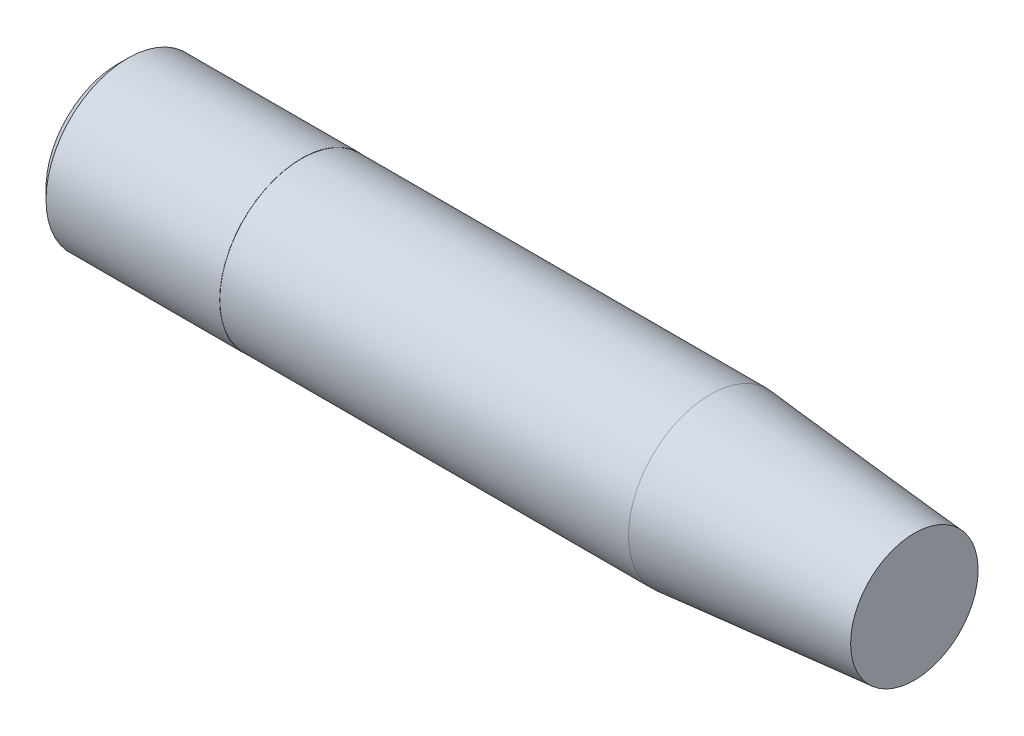
ISO-10303-21;
HEADER;
FILE_DESCRIPTION(('STEP AP214'),'2;1');
FILE_NAME('part.step','',(''),(''),'','','');
FILE_SCHEMA(('AUTOMOTIVE_DESIGN { 1 0 10303 214 1 1 1 1 }'));
ENDSEC;
DATA;
#1=APPLICATION_CONTEXT('core data for automotive mechanical design processes');
#2=APPLICATION_PROTOCOL_DEFINITION('international standard','automotive_design',2000,#1);
#3=PRODUCT_CONTEXT('',#1,'mechanical');
#4=PRODUCT('Part','Part','',(#3));
#5=PRODUCT_RELATED_PRODUCT_CATEGORY('part','',(#4));
#6=PRODUCT_DEFINITION_FORMATION('','',#4);
#7=PRODUCT_DEFINITION_CONTEXT('part definition',#1,'design');
#8=PRODUCT_DEFINITION('design','',#6,#7);
#9=PRODUCT_DEFINITION_SHAPE('','',#8);
#10=(LENGTH_UNIT() NAMED_UNIT(*) SI_UNIT(.MILLI.,.METRE.));
#11=(NAMED_UNIT(*) PLANE_ANGLE_UNIT() SI_UNIT($,.RADIAN.));
#12=(NAMED_UNIT(*) SI_UNIT($,.STERADIAN.) SOLID_ANGLE_UNIT());
#13=UNCERTAINTY_MEASURE_WITH_UNIT(LENGTH_MEASURE(1.E-05),#10,'distance_accuracy_value','');
#14=(GEOMETRIC_REPRESENTATION_CONTEXT(3) GLOBAL_UNCERTAINTY_ASSIGNED_CONTEXT((#13)) GLOBAL_UNIT_ASSIGNED_CONTEXT((#10,
#11,#12)) REPRESENTATION_CONTEXT('',''));
#15=CARTESIAN_POINT('',(0.,0.,0.));
#16=DIRECTION('',(0.,0.,1.));
#17=DIRECTION('',(1.,0.,0.));
#18=AXIS2_PLACEMENT_3D('',#15,#16,#17);
#19=CARTESIAN_POINT('',(19.5,0.,0.));
#20=DIRECTION('',(-1.,0.,0.));
#21=DIRECTION('',(0.,0.,1.));
#22=AXIS2_PLACEMENT_3D('',#19,#20,#21);
#23=PLANE('',#22);
#24=CARTESIAN_POINT('',(19.5,0.,0.));
#25=DIRECTION('',(-1.,0.,0.));
#26=DIRECTION('',(0.,0.,1.));
#27=AXIS2_PLACEMENT_3D('',#24,#25,#26);
#28=CIRCLE('',#27,1.56005668237038);
#29=CARTESIAN_POINT('',(19.5,0.,1.56005668237038));
#30=VERTEX_POINT('',#29);
#31=EDGE_CURVE('E10',#30,#30,#28,.T.);
#32=ORIENTED_EDGE('',*,*,#31,.F.);
#33=EDGE_LOOP('',(#32));
#34=FACE_BOUND('',#33,.T.);
#35=ADVANCED_FACE('F33',(#34),#23,.F.);
#36=CARTESIAN_POINT('',(19.5,0.,0.));
#37=DIRECTION('',(-1.,0.,0.));
#38=DIRECTION('',(0.,0.,1.));
#39=AXIS2_PLACEMENT_3D('',#36,#37,#38);
#40=CONICAL_SURFACE('',#39,1.56005668237038,0.0872664625997163);
#41=CARTESIAN_POINT('',(14.5,0.,0.));
#42=DIRECTION('',(-1.,0.,0.));
#43=DIRECTION('',(0.,0.,1.));
#44=AXIS2_PLACEMENT_3D('',#41,#42,#43);
#45=CIRCLE('',#44,1.9975);
#46=CARTESIAN_POINT('',(14.5,0.,1.9975));
#47=VERTEX_POINT('',#46);
#48=EDGE_CURVE('E39',#47,#47,#45,.T.);
#49=ORIENTED_EDGE('',*,*,#48,.F.);
#50=EDGE_LOOP('',(#49));
#51=FACE_BOUND('',#50,.T.);
#52=ORIENTED_EDGE('',*,*,#31,.T.);
#53=EDGE_LOOP('',(#52));
#54=FACE_BOUND('',#53,.T.);
#55=ADVANCED_FACE('F71',(#51,#54),#40,.T.);
#56=CARTESIAN_POINT('',(-30.1670840436527,0.,0.));
#57=DIRECTION('',(-1.,0.,0.));
#58=DIRECTION('',(0.,0.,1.));
#59=AXIS2_PLACEMENT_3D('',#56,#57,#58);
#60=CYLINDRICAL_SURFACE('',#59,1.9975);
#61=CARTESIAN_POINT('',(4.5,0.,0.));
#62=DIRECTION('',(-1.,0.,0.));
#63=DIRECTION('',(0.,0.,1.));
#64=AXIS2_PLACEMENT_3D('',#61,#62,#63);
#65=CIRCLE('',#64,1.9975);
#66=CARTESIAN_POINT('',(4.5,0.,1.9975));
#67=VERTEX_POINT('',#66);
#68=EDGE_CURVE('E43',#67,#67,#65,.T.);
#69=ORIENTED_EDGE('',*,*,#68,.F.);
#70=EDGE_LOOP('',(#69));
#71=FACE_BOUND('',#70,.T.);
#72=ORIENTED_EDGE('',*,*,#48,.T.);
#73=EDGE_LOOP('',(#72));
#74=FACE_BOUND('',#73,.T.);
#75=ADVANCED_FACE('F76',(#71,#74),#60,.T.);
#76=CARTESIAN_POINT('',(4.5,1.9975,0.));
#77=DIRECTION('',(-1.,0.,0.));
#78=DIRECTION('',(0.,0.,1.));
#79=AXIS2_PLACEMENT_3D('',#76,#77,#78);
#80=PLANE('',#79);
#81=CARTESIAN_POINT('',(4.5,0.,0.));
#82=DIRECTION('',(-1.,0.,0.));
#83=DIRECTION('',(0.,0.,1.));
#84=AXIS2_PLACEMENT_3D('',#81,#82,#83);
#85=CIRCLE('',#84,2.0025);
#86=CARTESIAN_POINT('',(4.5,0.,2.0025));
#87=VERTEX_POINT('',#86);
#88=EDGE_CURVE('E47',#87,#87,#85,.T.);
#89=ORIENTED_EDGE('',*,*,#88,.F.);
#90=EDGE_LOOP('',(#89));
#91=FACE_BOUND('',#90,.T.);
#92=ORIENTED_EDGE('',*,*,#68,.T.);
#93=EDGE_LOOP('',(#92));
#94=FACE_BOUND('',#93,.T.);
#95=ADVANCED_FACE('F81',(#91,#94),#80,.F.);
#96=CARTESIAN_POINT('',(-30.1670840436527,0.,0.));
#97=DIRECTION('',(-1.,0.,0.));
#98=DIRECTION('',(0.,0.,1.));
#99=AXIS2_PLACEMENT_3D('',#96,#97,#98);
#100=CYLINDRICAL_SURFACE('',#99,2.0025);
#101=CARTESIAN_POINT('',(0.25,0.,0.));
#102=DIRECTION('',(1.,0.,0.));
#103=DIRECTION('',(0.,0.,-1.));
#104=AXIS2_PLACEMENT_3D('',#101,#102,#103);
#105=CIRCLE('',#104,2.0025);
#106=CARTESIAN_POINT('',(0.25,0.,-2.0025));
#107=VERTEX_POINT('',#106);
#108=EDGE_CURVE('E52',#107,#107,#105,.T.);
#109=ORIENTED_EDGE('',*,*,#108,.T.);
#110=EDGE_LOOP('',(#109));
#111=FACE_BOUND('',#110,.T.);
#112=ORIENTED_EDGE('',*,*,#88,.T.);
#113=EDGE_LOOP('',(#112));
#114=FACE_BOUND('',#113,.T.);
#115=ADVANCED_FACE('F67',(#111,#114),#100,.T.);
#116=CARTESIAN_POINT('',(0.,0.,0.));
#117=DIRECTION('',(1.,0.,0.));
#118=DIRECTION('',(0.,0.,-1.));
#119=AXIS2_PLACEMENT_3D('',#116,#117,#118);
#120=CONICAL_SURFACE('',#119,1.7525,0.785398163397447);
#121=ORIENTED_EDGE('',*,*,#108,.F.);
#122=EDGE_LOOP('',(#121));
#123=FACE_BOUND('',#122,.T.);
#124=CARTESIAN_POINT('',(0.,0.,0.));
#125=DIRECTION('',(1.,0.,0.));
#126=DIRECTION('',(0.,0.,-1.));
#127=AXIS2_PLACEMENT_3D('',#124,#125,#126);
#128=CIRCLE('',#127,1.7525);
#129=CARTESIAN_POINT('',(0.,0.,-1.7525));
#130=VERTEX_POINT('',#129);
#131=EDGE_CURVE('E55',#130,#130,#128,.T.);
#132=ORIENTED_EDGE('',*,*,#131,.T.);
#133=EDGE_LOOP('',(#132));
#134=FACE_BOUND('',#133,.T.);
#135=ADVANCED_FACE('F59',(#123,#134),#120,.T.);
#136=CARTESIAN_POINT('',(0.,1.7525,0.));
#137=DIRECTION('',(1.,0.,0.));
#138=DIRECTION('',(0.,0.,-1.));
#139=AXIS2_PLACEMENT_3D('',#136,#137,#138);
#140=PLANE('',#139);
#141=ORIENTED_EDGE('',*,*,#131,.F.);
#142=EDGE_LOOP('',(#141));
#143=FACE_BOUND('',#142,.T.);
#144=ADVANCED_FACE('F61',(#143),#140,.F.);
#145=CLOSED_SHELL('',(#35,#55,#75,#95,#115,#135,#144));
#146=MANIFOLD_SOLID_BREP('B2',#145);
#147=ADVANCED_BREP_SHAPE_REPRESENTATION('',(#18,#146),#14);
#148=SHAPE_DEFINITION_REPRESENTATION(#9,#147);
ENDSEC;
END-ISO-10303-21;
